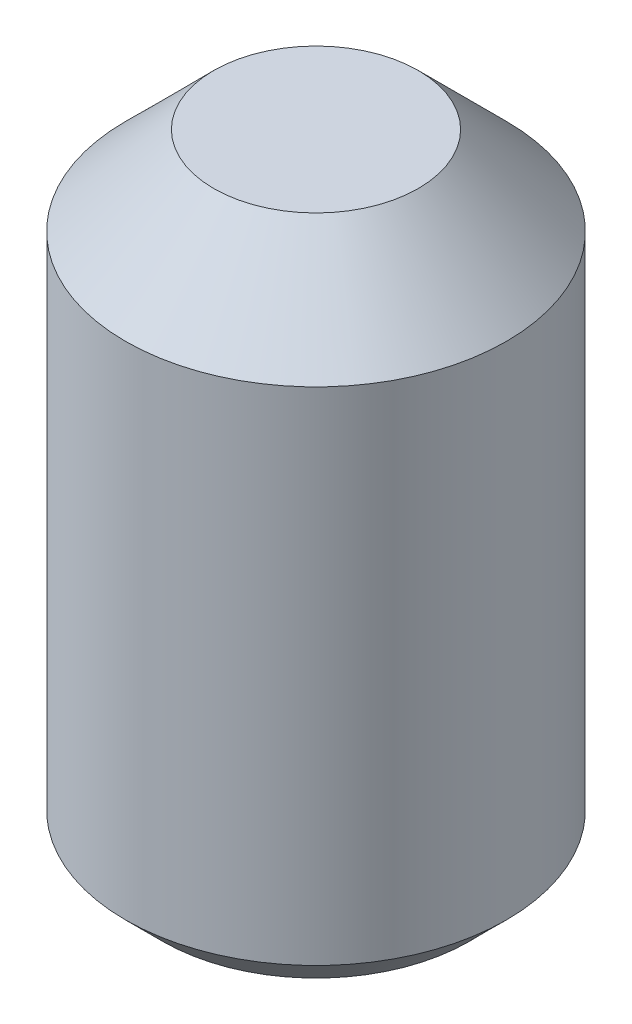
ISO-10303-21;
HEADER;
FILE_DESCRIPTION(('STEP AP214'),'2;1');
FILE_NAME('part.step','',(''),(''),'','','');
FILE_SCHEMA(('AUTOMOTIVE_DESIGN { 1 0 10303 214 1 1 1 1 }'));
ENDSEC;
DATA;
#1=APPLICATION_CONTEXT('core data for automotive mechanical design processes');
#2=APPLICATION_PROTOCOL_DEFINITION('international standard','automotive_design',2000,#1);
#3=PRODUCT_CONTEXT('',#1,'mechanical');
#4=PRODUCT('Part','Part','',(#3));
#5=PRODUCT_RELATED_PRODUCT_CATEGORY('part','',(#4));
#6=PRODUCT_DEFINITION_FORMATION('','',#4);
#7=PRODUCT_DEFINITION_CONTEXT('part definition',#1,'design');
#8=PRODUCT_DEFINITION('design','',#6,#7);
#9=PRODUCT_DEFINITION_SHAPE('','',#8);
#10=(LENGTH_UNIT() NAMED_UNIT(*) SI_UNIT(.MILLI.,.METRE.));
#11=(NAMED_UNIT(*) PLANE_ANGLE_UNIT() SI_UNIT($,.RADIAN.));
#12=(NAMED_UNIT(*) SI_UNIT($,.STERADIAN.) SOLID_ANGLE_UNIT());
#13=UNCERTAINTY_MEASURE_WITH_UNIT(LENGTH_MEASURE(1.E-05),#10,'distance_accuracy_value','');
#14=(GEOMETRIC_REPRESENTATION_CONTEXT(3) GLOBAL_UNCERTAINTY_ASSIGNED_CONTEXT((#13)) GLOBAL_UNIT_ASSIGNED_CONTEXT((#10,
#11,#12)) REPRESENTATION_CONTEXT('',''));
#15=CARTESIAN_POINT('',(0.,0.,0.));
#16=DIRECTION('',(0.,0.,1.));
#17=DIRECTION('',(1.,0.,0.));
#18=AXIS2_PLACEMENT_3D('',#15,#16,#17);
#19=CARTESIAN_POINT('',(0.68704079,0.,1.18998955515226));
#20=DIRECTION('',(0.,0.,1.));
#21=DIRECTION('',(1.,0.,0.));
#22=AXIS2_PLACEMENT_3D('',#19,#20,#21);
#23=PLANE('',#22);
#24=DIRECTION('',(0.,1.,0.));
#25=VECTOR('',#24,1.);
#26=CARTESIAN_POINT('',(-0.68704079,0.,1.18998955515226));
#27=LINE('',#26,#25);
#28=CARTESIAN_POINT('',(-0.68704079,0.,1.18998955515226));
#29=VERTEX_POINT('',#28);
#30=CARTESIAN_POINT('',(-0.68704079,2.54,1.18998955515226));
#31=VERTEX_POINT('',#30);
#32=EDGE_CURVE('E82',#29,#31,#27,.T.);
#33=ORIENTED_EDGE('',*,*,#32,.T.);
#34=DIRECTION('',(1.,0.,0.));
#35=VECTOR('',#34,1.);
#36=CARTESIAN_POINT('',(0.68704079,2.54,1.18998955515226));
#37=LINE('',#36,#35);
#38=CARTESIAN_POINT('',(0.68704079,2.54,1.18998955515226));
#39=VERTEX_POINT('',#38);
#40=EDGE_CURVE('E71',#39,#31,#37,.F.);
#41=ORIENTED_EDGE('',*,*,#40,.F.);
#42=DIRECTION('',(0.,1.,0.));
#43=VECTOR('',#42,1.);
#44=CARTESIAN_POINT('',(0.68704079,0.,1.18998955515226));
#45=LINE('',#44,#43);
#46=CARTESIAN_POINT('',(0.68704079,0.,1.18998955515226));
#47=VERTEX_POINT('',#46);
#48=EDGE_CURVE('E90',#39,#47,#45,.F.);
#49=ORIENTED_EDGE('',*,*,#48,.T.);
#50=DIRECTION('',(1.,0.,0.));
#51=VECTOR('',#50,1.);
#52=CARTESIAN_POINT('',(0.68704079,0.,1.18998955515226));
#53=LINE('',#52,#51);
#54=EDGE_CURVE('E66',#29,#47,#53,.T.);
#55=ORIENTED_EDGE('',*,*,#54,.F.);
#56=EDGE_LOOP('',(#33,#41,#49,#55));
#57=FACE_BOUND('',#56,.T.);
#58=ADVANCED_FACE('F16',(#57),#23,.F.);
#59=CARTESIAN_POINT('',(-0.68704079,0.,1.18998955515226));
#60=DIRECTION('',(-0.866025403784439,0.,0.5));
#61=DIRECTION('',(0.5,0.,0.866025403784439));
#62=AXIS2_PLACEMENT_3D('',#59,#60,#61);
#63=PLANE('',#62);
#64=DIRECTION('',(0.,1.,0.));
#65=VECTOR('',#64,1.);
#66=CARTESIAN_POINT('',(-1.37408158,0.,0.));
#67=LINE('',#66,#65);
#68=CARTESIAN_POINT('',(-1.37408158,0.,0.));
#69=VERTEX_POINT('',#68);
#70=CARTESIAN_POINT('',(-1.37408158,2.54,0.));
#71=VERTEX_POINT('',#70);
#72=EDGE_CURVE('E86',#69,#71,#67,.T.);
#73=ORIENTED_EDGE('',*,*,#72,.T.);
#74=DIRECTION('',(0.5,0.,0.866025403784439));
#75=VECTOR('',#74,1.);
#76=CARTESIAN_POINT('',(-0.68704079,2.54,1.18998955515226));
#77=LINE('',#76,#75);
#78=EDGE_CURVE('E75',#31,#71,#77,.F.);
#79=ORIENTED_EDGE('',*,*,#78,.F.);
#80=ORIENTED_EDGE('',*,*,#32,.F.);
#81=DIRECTION('',(0.5,0.,0.866025403784439));
#82=VECTOR('',#81,1.);
#83=CARTESIAN_POINT('',(-0.68704079,0.,1.18998955515226));
#84=LINE('',#83,#82);
#85=EDGE_CURVE('E88',#69,#29,#84,.T.);
#86=ORIENTED_EDGE('',*,*,#85,.F.);
#87=EDGE_LOOP('',(#73,#79,#80,#86));
#88=FACE_BOUND('',#87,.T.);
#89=ADVANCED_FACE('F85',(#88),#63,.F.);
#90=CARTESIAN_POINT('',(1.37408158,0.,0.));
#91=DIRECTION('',(0.866025403784439,0.,0.5));
#92=DIRECTION('',(0.5,0.,-0.866025403784439));
#93=AXIS2_PLACEMENT_3D('',#90,#91,#92);
#94=PLANE('',#93);
#95=ORIENTED_EDGE('',*,*,#48,.F.);
#96=DIRECTION('',(-0.5,0.,0.866025403784439));
#97=VECTOR('',#96,1.);
#98=CARTESIAN_POINT('',(1.37408158,2.54,0.));
#99=LINE('',#98,#97);
#100=CARTESIAN_POINT('',(1.37408158,2.54,0.));
#101=VERTEX_POINT('',#100);
#102=EDGE_CURVE('E78',#101,#39,#99,.T.);
#103=ORIENTED_EDGE('',*,*,#102,.F.);
#104=DIRECTION('',(0.,1.,0.));
#105=VECTOR('',#104,1.);
#106=CARTESIAN_POINT('',(1.37408158,0.,0.));
#107=LINE('',#106,#105);
#108=CARTESIAN_POINT('',(1.37408158,0.,0.));
#109=VERTEX_POINT('',#108);
#110=EDGE_CURVE('E121',#101,#109,#107,.F.);
#111=ORIENTED_EDGE('',*,*,#110,.T.);
#112=DIRECTION('',(0.5,0.,-0.866025403784439));
#113=VECTOR('',#112,1.);
#114=CARTESIAN_POINT('',(1.37408158,0.,0.));
#115=LINE('',#114,#113);
#116=EDGE_CURVE('E131',#47,#109,#115,.T.);
#117=ORIENTED_EDGE('',*,*,#116,.F.);
#118=EDGE_LOOP('',(#95,#103,#111,#117));
#119=FACE_BOUND('',#118,.T.);
#120=ADVANCED_FACE('F134',(#119),#94,.F.);
#121=CARTESIAN_POINT('',(-1.37408158,0.,0.));
#122=DIRECTION('',(-0.866025403784439,0.,-0.5));
#123=DIRECTION('',(-0.5,0.,0.866025403784439));
#124=AXIS2_PLACEMENT_3D('',#121,#122,#123);
#125=PLANE('',#124);
#126=DIRECTION('',(0.,1.,0.));
#127=VECTOR('',#126,1.);
#128=CARTESIAN_POINT('',(-0.68704079,0.,-1.18998955515226));
#129=LINE('',#128,#127);
#130=CARTESIAN_POINT('',(-0.68704079,0.,-1.18998955515226));
#131=VERTEX_POINT('',#130);
#132=CARTESIAN_POINT('',(-0.68704079,2.54,-1.18998955515226));
#133=VERTEX_POINT('',#132);
#134=EDGE_CURVE('E117',#131,#133,#129,.T.);
#135=ORIENTED_EDGE('',*,*,#134,.T.);
#136=DIRECTION('',(0.5,0.,-0.866025403784439));
#137=VECTOR('',#136,1.);
#138=CARTESIAN_POINT('',(-1.37408158,2.54,0.));
#139=LINE('',#138,#137);
#140=EDGE_CURVE('E126',#71,#133,#139,.T.);
#141=ORIENTED_EDGE('',*,*,#140,.F.);
#142=ORIENTED_EDGE('',*,*,#72,.F.);
#143=DIRECTION('',(-0.5,0.,0.866025403784439));
#144=VECTOR('',#143,1.);
#145=CARTESIAN_POINT('',(-1.37408158,0.,0.));
#146=LINE('',#145,#144);
#147=EDGE_CURVE('E34',#131,#69,#146,.T.);
#148=ORIENTED_EDGE('',*,*,#147,.F.);
#149=EDGE_LOOP('',(#135,#141,#142,#148));
#150=FACE_BOUND('',#149,.T.);
#151=ADVANCED_FACE('F140',(#150),#125,.F.);
#152=CARTESIAN_POINT('',(0.,2.54,0.));
#153=DIRECTION('',(0.,-1.,0.));
#154=DIRECTION('',(0.,0.,-1.));
#155=AXIS2_PLACEMENT_3D('',#152,#153,#154);
#156=PLANE('',#155);
#157=ORIENTED_EDGE('',*,*,#78,.T.);
#158=ORIENTED_EDGE('',*,*,#140,.T.);
#159=DIRECTION('',(-1.,0.,0.));
#160=VECTOR('',#159,1.);
#161=CARTESIAN_POINT('',(-0.68704079,2.54,-1.18998955515226));
#162=LINE('',#161,#160);
#163=CARTESIAN_POINT('',(0.68704079,2.54,-1.18998955515226));
#164=VERTEX_POINT('',#163);
#165=EDGE_CURVE('E111',#133,#164,#162,.F.);
#166=ORIENTED_EDGE('',*,*,#165,.T.);
#167=DIRECTION('',(-0.5,0.,-0.866025403784439));
#168=VECTOR('',#167,1.);
#169=CARTESIAN_POINT('',(0.68704079,2.54,-1.18998955515226));
#170=LINE('',#169,#168);
#171=EDGE_CURVE('E124',#164,#101,#170,.F.);
#172=ORIENTED_EDGE('',*,*,#171,.T.);
#173=ORIENTED_EDGE('',*,*,#102,.T.);
#174=ORIENTED_EDGE('',*,*,#40,.T.);
#175=EDGE_LOOP('',(#157,#158,#166,#172,#173,#174));
#176=FACE_BOUND('',#175,.T.);
#177=ADVANCED_FACE('F72',(#176),#156,.T.);
#178=CARTESIAN_POINT('',(0.68704079,0.,-1.18998955515226));
#179=DIRECTION('',(0.866025403784439,0.,-0.5));
#180=DIRECTION('',(-0.5,0.,-0.866025403784439));
#181=AXIS2_PLACEMENT_3D('',#178,#179,#180);
#182=PLANE('',#181);
#183=ORIENTED_EDGE('',*,*,#110,.F.);
#184=ORIENTED_EDGE('',*,*,#171,.F.);
#185=DIRECTION('',(0.,1.,0.));
#186=VECTOR('',#185,1.);
#187=CARTESIAN_POINT('',(0.68704079,0.,-1.18998955515226));
#188=LINE('',#187,#186);
#189=CARTESIAN_POINT('',(0.68704079,0.,-1.18998955515226));
#190=VERTEX_POINT('',#189);
#191=EDGE_CURVE('E105',#164,#190,#188,.F.);
#192=ORIENTED_EDGE('',*,*,#191,.T.);
#193=DIRECTION('',(-0.5,0.,-0.866025403784439));
#194=VECTOR('',#193,1.);
#195=CARTESIAN_POINT('',(0.68704079,0.,-1.18998955515226));
#196=LINE('',#195,#194);
#197=EDGE_CURVE('E119',#109,#190,#196,.T.);
#198=ORIENTED_EDGE('',*,*,#197,.F.);
#199=EDGE_LOOP('',(#183,#184,#192,#198));
#200=FACE_BOUND('',#199,.T.);
#201=ADVANCED_FACE('F145',(#200),#182,.F.);
#202=CARTESIAN_POINT('',(-0.68704079,0.,-1.18998955515226));
#203=DIRECTION('',(0.,0.,-1.));
#204=DIRECTION('',(-1.,0.,0.));
#205=AXIS2_PLACEMENT_3D('',#202,#203,#204);
#206=PLANE('',#205);
#207=ORIENTED_EDGE('',*,*,#191,.F.);
#208=ORIENTED_EDGE('',*,*,#165,.F.);
#209=ORIENTED_EDGE('',*,*,#134,.F.);
#210=DIRECTION('',(1.,0.,0.));
#211=VECTOR('',#210,1.);
#212=CARTESIAN_POINT('',(0.,0.,-1.18998955515226));
#213=LINE('',#212,#211);
#214=EDGE_CURVE('E101',#131,#190,#213,.T.);
#215=ORIENTED_EDGE('',*,*,#214,.T.);
#216=EDGE_LOOP('',(#207,#208,#209,#215));
#217=FACE_BOUND('',#216,.T.);
#218=ADVANCED_FACE('F143',(#217),#206,.F.);
#219=CARTESIAN_POINT('',(0.,0.,0.));
#220=DIRECTION('',(0.,1.,0.));
#221=DIRECTION('',(0.,0.,1.));
#222=AXIS2_PLACEMENT_3D('',#219,#220,#221);
#223=PLANE('',#222);
#224=ORIENTED_EDGE('',*,*,#147,.T.);
#225=ORIENTED_EDGE('',*,*,#85,.T.);
#226=ORIENTED_EDGE('',*,*,#54,.T.);
#227=ORIENTED_EDGE('',*,*,#116,.T.);
#228=ORIENTED_EDGE('',*,*,#197,.T.);
#229=ORIENTED_EDGE('',*,*,#214,.F.);
#230=EDGE_LOOP('',(#224,#225,#226,#227,#228,#229));
#231=FACE_BOUND('',#230,.T.);
#232=CARTESIAN_POINT('',(0.,0.,0.));
#233=DIRECTION('',(0.,1.,0.));
#234=DIRECTION('',(0.,0.,1.));
#235=AXIS2_PLACEMENT_3D('',#232,#233,#234);
#236=CIRCLE('',#235,1.94055999992315);
#237=CARTESIAN_POINT('',(0.,0.,1.94055999992315));
#238=VERTEX_POINT('',#237);
#239=EDGE_CURVE('E19',#238,#238,#236,.T.);
#240=ORIENTED_EDGE('',*,*,#239,.F.);
#241=EDGE_LOOP('',(#240));
#242=FACE_BOUND('',#241,.T.);
#243=ADVANCED_FACE('F138',(#231,#242),#223,.F.);
#244=CARTESIAN_POINT('',(0.,7.9375,0.));
#245=DIRECTION('',(0.,1.,0.));
#246=DIRECTION('',(0.,0.,1.));
#247=AXIS2_PLACEMENT_3D('',#244,#245,#246);
#248=PLANE('',#247);
#249=CARTESIAN_POINT('',(0.,7.93749999991178,0.));
#250=DIRECTION('',(0.,-1.,0.));
#251=DIRECTION('',(0.,0.,-1.));
#252=AXIS2_PLACEMENT_3D('',#249,#250,#251);
#253=CIRCLE('',#252,1.29540000000361);
#254=CARTESIAN_POINT('',(0.,7.93749999991178,-1.29540000000361));
#255=VERTEX_POINT('',#254);
#256=EDGE_CURVE('E94',#255,#255,#253,.T.);
#257=ORIENTED_EDGE('',*,*,#256,.F.);
#258=EDGE_LOOP('',(#257));
#259=FACE_BOUND('',#258,.T.);
#260=ADVANCED_FACE('F170',(#259),#248,.T.);
#261=CARTESIAN_POINT('',(0.,0.472440000066854,0.));
#262=DIRECTION('',(0.,1.,0.));
#263=DIRECTION('',(0.,0.,1.));
#264=AXIS2_PLACEMENT_3D('',#261,#262,#263);
#265=CONICAL_SURFACE('',#264,2.41299999999001,0.785398163397449);
#266=CARTESIAN_POINT('',(0.,0.47244,0.));
#267=DIRECTION('',(0.,1.,0.));
#268=DIRECTION('',(0.,0.,1.));
#269=AXIS2_PLACEMENT_3D('',#266,#267,#268);
#270=CIRCLE('',#269,2.413);
#271=CARTESIAN_POINT('',(0.,0.47244,2.413));
#272=VERTEX_POINT('',#271);
#273=EDGE_CURVE('E25',#272,#272,#270,.T.);
#274=ORIENTED_EDGE('',*,*,#273,.F.);
#275=EDGE_LOOP('',(#274));
#276=FACE_BOUND('',#275,.T.);
#277=ORIENTED_EDGE('',*,*,#239,.T.);
#278=EDGE_LOOP('',(#277));
#279=FACE_BOUND('',#278,.T.);
#280=ADVANCED_FACE('F163',(#276,#279),#265,.T.);
#281=CARTESIAN_POINT('',(0.,6.81989999998223,0.));
#282=DIRECTION('',(0.,-1.,0.));
#283=DIRECTION('',(0.,0.,-1.));
#284=AXIS2_PLACEMENT_3D('',#281,#282,#283);
#285=CONICAL_SURFACE('',#284,2.41299999993316,0.785398163397448);
#286=CARTESIAN_POINT('',(0.,6.8199,0.));
#287=DIRECTION('',(0.,1.,0.));
#288=DIRECTION('',(0.,0.,1.));
#289=AXIS2_PLACEMENT_3D('',#286,#287,#288);
#290=CIRCLE('',#289,2.413);
#291=CARTESIAN_POINT('',(0.,6.8199,2.413));
#292=VERTEX_POINT('',#291);
#293=EDGE_CURVE('E10',#292,#292,#290,.F.);
#294=ORIENTED_EDGE('',*,*,#293,.F.);
#295=EDGE_LOOP('',(#294));
#296=FACE_BOUND('',#295,.T.);
#297=ORIENTED_EDGE('',*,*,#256,.T.);
#298=EDGE_LOOP('',(#297));
#299=FACE_BOUND('',#298,.T.);
#300=ADVANCED_FACE('F157',(#296,#299),#285,.T.);
#301=CARTESIAN_POINT('',(0.,0.,0.));
#302=DIRECTION('',(0.,1.,0.));
#303=DIRECTION('',(0.,0.,1.));
#304=AXIS2_PLACEMENT_3D('',#301,#302,#303);
#305=CYLINDRICAL_SURFACE('',#304,2.413);
#306=ORIENTED_EDGE('',*,*,#293,.T.);
#307=EDGE_LOOP('',(#306));
#308=FACE_BOUND('',#307,.T.);
#309=ORIENTED_EDGE('',*,*,#273,.T.);
#310=EDGE_LOOP('',(#309));
#311=FACE_BOUND('',#310,.T.);
#312=ADVANCED_FACE('F155',(#308,#311),#305,.T.);
#313=CLOSED_SHELL('',(#58,#89,#120,#151,#177,#201,#218,#243,#260,#280,#300,#312));
#314=MANIFOLD_SOLID_BREP('B1',#313);
#315=ADVANCED_BREP_SHAPE_REPRESENTATION('',(#18,#314),#14);
#316=SHAPE_DEFINITION_REPRESENTATION(#9,#315);
ENDSEC;
END-ISO-10303-21;
